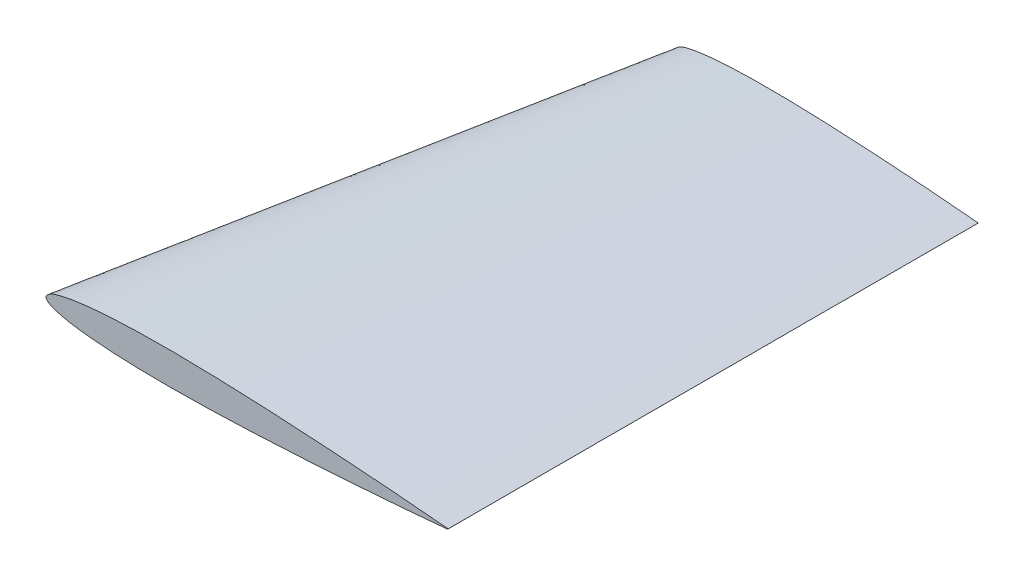
ISO-10303-21;
HEADER;
FILE_DESCRIPTION(('STEP AP214'),'2;1');
FILE_NAME('part.step','',(''),(''),'','','');
FILE_SCHEMA(('AUTOMOTIVE_DESIGN { 1 0 10303 214 1 1 1 1 }'));
ENDSEC;
DATA;
#1=APPLICATION_CONTEXT('core data for automotive mechanical design processes');
#2=APPLICATION_PROTOCOL_DEFINITION('international standard','automotive_design',2000,#1);
#3=PRODUCT_CONTEXT('',#1,'mechanical');
#4=PRODUCT('Part','Part','',(#3));
#5=PRODUCT_RELATED_PRODUCT_CATEGORY('part','',(#4));
#6=PRODUCT_DEFINITION_FORMATION('','',#4);
#7=PRODUCT_DEFINITION_CONTEXT('part definition',#1,'design');
#8=PRODUCT_DEFINITION('design','',#6,#7);
#9=PRODUCT_DEFINITION_SHAPE('','',#8);
#10=(LENGTH_UNIT() NAMED_UNIT(*) SI_UNIT(.MILLI.,.METRE.));
#11=(NAMED_UNIT(*) PLANE_ANGLE_UNIT() SI_UNIT($,.RADIAN.));
#12=(NAMED_UNIT(*) SI_UNIT($,.STERADIAN.) SOLID_ANGLE_UNIT());
#13=UNCERTAINTY_MEASURE_WITH_UNIT(LENGTH_MEASURE(1.E-05),#10,'distance_accuracy_value','');
#14=(GEOMETRIC_REPRESENTATION_CONTEXT(3) GLOBAL_UNCERTAINTY_ASSIGNED_CONTEXT((#13)) GLOBAL_UNIT_ASSIGNED_CONTEXT((#10,
#11,#12)) REPRESENTATION_CONTEXT('',''));
#15=CARTESIAN_POINT('',(0.,0.,0.));
#16=DIRECTION('',(0.,0.,1.));
#17=DIRECTION('',(1.,0.,0.));
#18=AXIS2_PLACEMENT_3D('',#15,#16,#17);
#19=CARTESIAN_POINT('',(0.,0.,0.));
#20=DIRECTION('',(0.,0.,-1.));
#21=DIRECTION('',(-1.,0.,0.));
#22=AXIS2_PLACEMENT_3D('',#19,#20,#21);
#23=PLANE('',#22);
#24=CARTESIAN_POINT('',(131.,0.11004,0.));
#25=CARTESIAN_POINT('',(128.816870347562,0.310137888872527,0.));
#26=CARTESIAN_POINT('',(124.451565090307,0.710246222010464,0.));
#27=CARTESIAN_POINT('',(115.719583103756,1.45527766400517,0.));
#28=CARTESIAN_POINT('',(104.804314296648,2.31033040372466,0.));
#29=CARTESIAN_POINT('',(91.7039286028267,3.21979881723269,0.));
#30=CARTESIAN_POINT('',(78.6040670592815,4.01088951775883,0.));
#31=CARTESIAN_POINT('',(65.5039412667009,4.65330236732744,0.));
#32=CARTESIAN_POINT('',(52.4034041105768,5.11285990678068,0.));
#33=CARTESIAN_POINT('',(41.4837195464556,5.27309079736383,0.));
#34=CARTESIAN_POINT('',(32.7488925264283,5.20978326604601,0.));
#35=CARTESIAN_POINT('',(26.1970860186864,5.03691908178291,0.));
#36=CARTESIAN_POINT('',(19.6413057022108,4.70615791578935,0.));
#37=CARTESIAN_POINT('',(14.1836111249939,4.24132356838005,0.));
#38=CARTESIAN_POINT('',(9.81066124828353,3.68636799044943,0.));
#39=CARTESIAN_POINT('',(6.54160899166983,3.14881170766803,0.));
#40=CARTESIAN_POINT('',(3.73301050518204,2.44698239752032,0.));
#41=CARTESIAN_POINT('',(1.52669168859384,1.73049329989823,0.));
#42=CARTESIAN_POINT('',(-0.870644057206406,0.,0.));
#43=CARTESIAN_POINT('',(1.52669168859384,-1.73049329989822,0.));
#44=CARTESIAN_POINT('',(3.73301050518204,-2.44698239752032,0.));
#45=CARTESIAN_POINT('',(6.54160899166982,-3.14881170766803,0.));
#46=CARTESIAN_POINT('',(9.81066124828353,-3.68636799044943,0.));
#47=CARTESIAN_POINT('',(14.1836111249939,-4.24132356838005,0.));
#48=CARTESIAN_POINT('',(19.6413057022108,-4.70615791578935,0.));
#49=CARTESIAN_POINT('',(26.1970860186863,-5.03691908178291,0.));
#50=CARTESIAN_POINT('',(32.7488925264283,-5.20978326604601,0.));
#51=CARTESIAN_POINT('',(41.4837195464556,-5.27309079736383,0.));
#52=CARTESIAN_POINT('',(52.4034041105768,-5.11285990678068,0.));
#53=CARTESIAN_POINT('',(65.503941266701,-4.65330236732744,0.));
#54=CARTESIAN_POINT('',(78.6040670592815,-4.01088951775883,0.));
#55=CARTESIAN_POINT('',(91.7039286028267,-3.21979881723269,0.));
#56=CARTESIAN_POINT('',(104.804314296648,-2.31033040372466,0.));
#57=CARTESIAN_POINT('',(115.719583103756,-1.45527766400517,0.));
#58=CARTESIAN_POINT('',(124.451565090307,-0.710246222010463,0.));
#59=CARTESIAN_POINT('',(128.816870347562,-0.310137888872527,0.));
#60=CARTESIAN_POINT('',(131.,-0.11004,0.));
#61=B_SPLINE_CURVE_WITH_KNOTS('',3,(#24,#25,#26,#27,#28,#29,#30,#31,#32,#33,#34,#35,#36,#37,#38,
#39,#40,#41,#42,#43,#44,#45,#46,#47,#48,#49,#50,#51,#52,#53,#54,#55,#56,#57,#58,#59,#60),
.UNSPECIFIED.,.F.,.F.,(4,1,1,1,1,1,1,1,1,1,1,1,1,1,1,1,1,1,1,1,1,1,1,1,1,1,1,1,1,1,1,1,1,1,4),
(0.,0.0248762929189861,0.0497417146704998,0.099443402111095,0.149112224036195,0.198750974066913,
0.248359097492202,0.297937369716024,0.347491327096237,0.37226694027957,0.39705092368842,
0.421859474838904,0.446731345826762,0.459220451479859,0.471790601601357,0.484560454432956,
0.491195112481227,0.5,0.508804887518773,0.515439545567044,0.528209398398643,0.540779548520141,
0.553268654173238,0.578140525161096,0.60294907631158,0.62773305972043,0.652508672903763,
0.702062630283976,0.751640902507798,0.801249025933087,0.850887775963805,0.900556597888905,
0.9502582853295,0.975123707081014,1.),.UNSPECIFIED.);
#62=CARTESIAN_POINT('',(131.,0.11004,0.));
#63=VERTEX_POINT('',#62);
#64=CARTESIAN_POINT('',(131.,-0.11004,0.));
#65=VERTEX_POINT('',#64);
#66=EDGE_CURVE('E81',#63,#65,#61,.T.);
#67=ORIENTED_EDGE('',*,*,#66,.T.);
#68=CARTESIAN_POINT('',(130.9899141255,0.,0.));
#69=DIRECTION('',(0.,0.,1.));
#70=DIRECTION('',(-1.,0.,0.));
#71=AXIS2_PLACEMENT_3D('',#68,#69,#70);
#72=CIRCLE('',#71,0.11050125096318);
#73=EDGE_CURVE('E12',#65,#63,#72,.T.);
#74=ORIENTED_EDGE('',*,*,#73,.T.);
#75=EDGE_LOOP('',(#67,#74));
#76=FACE_BOUND('',#75,.T.);
#77=ADVANCED_FACE('F71',(#76),#23,.F.);
#78=CARTESIAN_POINT('',(32.7000000000001,-0.082572000000003,-173.));
#79=DIRECTION('',(0.,0.,-1.));
#80=DIRECTION('',(-1.,0.,0.));
#81=AXIS2_PLACEMENT_3D('',#78,#79,#80);
#82=PLANE('',#81);
#83=CARTESIAN_POINT('',(131.,0.,-173.));
#84=CARTESIAN_POINT('',(129.361819505079,0.150149789894423,-173.));
#85=CARTESIAN_POINT('',(126.086174415093,0.450383752852127,-173.));
#86=CARTESIAN_POINT('',(119.533855107628,1.00944169749395,-173.));
#87=CARTESIAN_POINT('',(111.343237369164,1.6510576082911,-173.));
#88=CARTESIAN_POINT('',(101.512947951587,2.33350604377078,-173.));
#89=CARTESIAN_POINT('',(91.6830518467739,2.92712601218086,-173.));
#90=CARTESIAN_POINT('',(81.852957454326,3.40918084510142,-173.));
#91=CARTESIAN_POINT('',(72.0225543822115,3.75402440333237,-173.));
#92=CARTESIAN_POINT('',(63.8286231405847,3.8742587280982,-173.));
#93=CARTESIAN_POINT('',(57.2741689721214,3.82675391642994,-173.));
#94=CARTESIAN_POINT('',(52.3578134018082,3.69703979953633,-173.));
#95=CARTESIAN_POINT('',(47.4384759582238,3.44884268032131,-173.));
#96=CARTESIAN_POINT('',(43.3431219357779,3.10003950207449,-173.));
#97=CARTESIAN_POINT('',(40.0617404634067,2.68361100352044,-173.));
#98=CARTESIAN_POINT('',(37.6087035410775,2.28023861728066,-173.));
#99=CARTESIAN_POINT('',(35.5011826920565,1.75359876088738,-173.));
#100=CARTESIAN_POINT('',(33.8456014731968,1.21595846854958,-173.));
#101=CARTESIAN_POINT('',(32.0466846502032,-0.082572000000003,-173.));
#102=CARTESIAN_POINT('',(33.8456014731968,-1.38110246854959,-173.));
#103=CARTESIAN_POINT('',(35.5011826920565,-1.91874276088739,-173.));
#104=CARTESIAN_POINT('',(37.6087035410775,-2.44538261728067,-173.));
#105=CARTESIAN_POINT('',(40.0617404634067,-2.84875500352045,-173.));
#106=CARTESIAN_POINT('',(43.3431219357779,-3.2651835020745,-173.));
#107=CARTESIAN_POINT('',(47.4384759582239,-3.61398668032132,-173.));
#108=CARTESIAN_POINT('',(52.3578134018082,-3.86218379953634,-173.));
#109=CARTESIAN_POINT('',(57.2741689721214,-3.99189791642995,-173.));
#110=CARTESIAN_POINT('',(63.8286231405847,-4.0394027280982,-173.));
#111=CARTESIAN_POINT('',(72.0225543822115,-3.91916840333238,-173.));
#112=CARTESIAN_POINT('',(81.852957454326,-3.57432484510143,-173.));
#113=CARTESIAN_POINT('',(91.6830518467739,-3.09227001218087,-173.));
#114=CARTESIAN_POINT('',(101.512947951587,-2.49865004377079,-173.));
#115=CARTESIAN_POINT('',(111.343237369164,-1.81620160829111,-173.));
#116=CARTESIAN_POINT('',(119.533855107628,-1.17458569749396,-173.));
#117=CARTESIAN_POINT('',(126.086174415093,-0.615527752852125,-173.));
#118=CARTESIAN_POINT('',(129.361819505079,-0.315293789894429,-173.));
#119=CARTESIAN_POINT('',(131.,-0.165144000000006,-173.));
#120=B_SPLINE_CURVE_WITH_KNOTS('',3,(#83,#84,#85,#86,#87,#88,#89,#90,#91,#92,#93,#94,#95,#96,
#97,#98,#99,#100,#101,#102,#103,#104,#105,#106,#107,#108,#109,#110,#111,#112,#113,#114,#115,
#116,#117,#118,#119),.UNSPECIFIED.,.F.,.F.,(4,1,1,1,1,1,1,1,1,1,1,1,1,1,1,1,1,1,1,1,1,1,1,1,1,1,
1,1,1,1,1,1,1,1,4),(0.,0.0248762929189861,0.0497417146704998,0.099443402111095,
0.149112224036195,0.198750974066913,0.248359097492202,0.297937369716024,0.347491327096237,
0.37226694027957,0.39705092368842,0.421859474838904,0.446731345826762,0.459220451479859,
0.471790601601357,0.484560454432956,0.491195112481227,0.5,0.508804887518773,0.515439545567044,
0.528209398398643,0.540779548520141,0.553268654173238,0.578140525161096,0.60294907631158,
0.62773305972043,0.652508672903763,0.702062630283976,0.751640902507798,0.801249025933087,
0.850887775963805,0.900556597888905,0.9502582853295,0.975123707081014,1.),.UNSPECIFIED.);
#121=CARTESIAN_POINT('',(131.,0.,-173.));
#122=VERTEX_POINT('',#121);
#123=CARTESIAN_POINT('',(131.,-0.165144000000006,-173.));
#124=VERTEX_POINT('',#123);
#125=EDGE_CURVE('E103',#122,#124,#120,.T.);
#126=ORIENTED_EDGE('',*,*,#125,.F.);
#127=CARTESIAN_POINT('',(130.992431744555,-0.082572000000003,-173.));
#128=DIRECTION('',(0.,0.,1.));
#129=DIRECTION('',(-1.,0.,0.));
#130=AXIS2_PLACEMENT_3D('',#127,#128,#129);
#131=CIRCLE('',#130,0.0829181142723741);
#132=EDGE_CURVE('E99',#124,#122,#131,.T.);
#133=ORIENTED_EDGE('',*,*,#132,.F.);
#134=EDGE_LOOP('',(#126,#133));
#135=FACE_BOUND('',#134,.T.);
#136=ADVANCED_FACE('F110',(#135),#82,.T.);
#137=CARTESIAN_POINT('',(131.000000117433,-1.07634536310093E-08,-173.));
#138=CARTESIAN_POINT('',(131.000000156497,0.110039985656027,0.));
#139=CARTESIAN_POINT('',(128.940535608968,0.188763171437657,-173.));
#140=CARTESIAN_POINT('',(128.255444199133,0.361596210155981,0.));
#141=CARTESIAN_POINT('',(124.821417388266,0.564319355523281,-173.));
#142=CARTESIAN_POINT('',(122.766103718397,0.862343973612104,0.));
#143=CARTESIAN_POINT('',(118.638415811473,1.07835420981064,-173.));
#144=CARTESIAN_POINT('',(114.526264947384,1.54710386527621,0.));
#145=CARTESIAN_POINT('',(112.452854741183,1.56007575582809,-173.));
#146=CARTESIAN_POINT('',(106.28304933928,2.18911739577432,0.));
#147=CARTESIAN_POINT('',(107.295932793868,1.93129107762501,-173.));
#148=CARTESIAN_POINT('',(99.4106390484241,2.6837360028312,0.));
#149=CARTESIAN_POINT('',(103.169238375079,2.21140601886975,-173.));
#150=CARTESIAN_POINT('',(93.9111935478654,3.05717823238518,0.));
#151=CARTESIAN_POINT('',(100.07363496155,2.41271084376189,-173.));
#152=CARTESIAN_POINT('',(89.7857991751592,3.32524057747349,0.));
#153=CARTESIAN_POINT('',(96.9774447796151,2.60488156466758,-173.));
#154=CARTESIAN_POINT('',(85.6596633529894,3.58152165986858,0.));
#155=CARTESIAN_POINT('',(93.8806709355054,2.78731927908606,-173.));
#156=CARTESIAN_POINT('',(81.5327193590375,3.82453655105182,0.));
#157=CARTESIAN_POINT('',(90.7832868897655,2.95916377116404,-173.));
#158=CARTESIAN_POINT('',(77.404979763622,4.05360543696512,0.));
#159=CARTESIAN_POINT('',(87.6853015643457,3.11977639567504,-173.));
#160=CARTESIAN_POINT('',(73.2764295832048,4.2676150261703,0.));
#161=CARTESIAN_POINT('',(84.5867092984731,3.26826367325096,-173.));
#162=CARTESIAN_POINT('',(69.1470755263409,4.46551505606886,0.));
#163=CARTESIAN_POINT('',(81.487527498053,3.40388943812452,-173.));
#164=CARTESIAN_POINT('',(65.0169331076416,4.64624889820928,0.));
#165=CARTESIAN_POINT('',(78.3877704757895,3.52571419004602,-173.));
#166=CARTESIAN_POINT('',(60.8860255402092,4.80860291784415,0.));
#167=CARTESIAN_POINT('',(75.2874278431419,3.63167209711995,-173.));
#168=CARTESIAN_POINT('',(56.7543366940631,4.94980724428431,0.));
#169=CARTESIAN_POINT('',(72.1865240936337,3.71979595169325,-173.));
#170=CARTESIAN_POINT('',(52.6219005517895,5.06724286298066,0.));
#171=CARTESIAN_POINT('',(69.0851167521275,3.78807222525769,-173.));
#172=CARTESIAN_POINT('',(48.4887925059737,5.15824019944036,0.));
#173=CARTESIAN_POINT('',(65.9832894315635,3.83385619836307,-173.));
#174=CARTESIAN_POINT('',(44.3551260187667,5.21923688813428,0.));
#175=CARTESIAN_POINT('',(63.3982050168251,3.85089458530804,-173.));
#176=CARTESIAN_POINT('',(40.9100971235666,5.24197139286719,0.));
#177=CARTESIAN_POINT('',(61.3301034065557,3.85061251698062,-173.));
#178=CARTESIAN_POINT('',(38.154032222539,5.24155079378142,0.));
#179=CARTESIAN_POINT('',(59.7790484884829,3.84283285140709,-173.));
#180=CARTESIAN_POINT('',(36.087008896172,5.23123700158345,0.));
#181=CARTESIAN_POINT('',(58.2280531889082,3.82687334611934,-173.));
#182=CARTESIAN_POINT('',(34.0200678570569,5.20992524551563,0.));
#183=CARTESIAN_POINT('',(56.6771764854332,3.80193715981825,-173.));
#184=CARTESIAN_POINT('',(31.9532827829952,5.17671998816251,0.));
#185=CARTESIAN_POINT('',(55.1264822985738,3.76738953883367,-173.));
#186=CARTESIAN_POINT('',(29.8867421936242,5.13066537965312,0.));
#187=CARTESIAN_POINT('',(53.5760548668532,3.72240291490398,-173.));
#188=CARTESIAN_POINT('',(27.8205563689873,5.0707211443432,0.));
#189=CARTESIAN_POINT('',(52.0259882159556,3.66630644317744,-173.));
#190=CARTESIAN_POINT('',(25.7548518154808,4.99595987545832,0.));
#191=CARTESIAN_POINT('',(50.4764014926564,3.59817952830777,-173.));
#192=CARTESIAN_POINT('',(23.6897864395041,4.90517196351075,0.));
#193=CARTESIAN_POINT('',(48.927474033696,3.51633543285021,-173.));
#194=CARTESIAN_POINT('',(21.6256001695,4.79610035625126,0.));
#195=CARTESIAN_POINT('',(47.3794265324786,3.41921832074653,-173.));
#196=CARTESIAN_POINT('',(19.5625856983689,4.66667764298223,0.));
#197=CARTESIAN_POINT('',(45.8325277464505,3.30515882496449,-173.));
#198=CARTESIAN_POINT('',(17.5011033538569,4.51467288472591,0.));
#199=CARTESIAN_POINT('',(44.5447807859301,3.19336591990307,-173.));
#200=CARTESIAN_POINT('',(15.7849786937545,4.36569544410332,0.));
#201=CARTESIAN_POINT('',(43.5156681809466,3.09235968240072,-173.));
#202=CARTESIAN_POINT('',(14.4135294664583,4.23108375381585,0.));
#203=CARTESIAN_POINT('',(42.7444658980599,3.01043816350297,-173.));
#204=CARTESIAN_POINT('',(13.385781106398,4.12191362829317,0.));
#205=CARTESIAN_POINT('',(41.9739854751587,2.92196891978985,-173.));
#206=CARTESIAN_POINT('',(12.3589973740668,4.00401313339227,0.));
#207=CARTESIAN_POINT('',(41.2043428875929,2.82646830450108,-173.));
#208=CARTESIAN_POINT('',(11.3333282486829,3.87674401009911,0.));
#209=CARTESIAN_POINT('',(40.4357229827067,2.72305872677674,-173.));
#210=CARTESIAN_POINT('',(10.3090232603011,3.73893462844862,0.));
#211=CARTESIAN_POINT('',(39.6682444382446,2.61146330691477,-173.));
#212=CARTESIAN_POINT('',(9.28623851726055,3.5902148636516,0.));
#213=CARTESIAN_POINT('',(38.9023589118707,2.48935419852189,-173.));
#214=CARTESIAN_POINT('',(8.26557739202732,3.4274876845354,0.));
#215=CARTESIAN_POINT('',(38.138836201531,2.35313692738351,-173.));
#216=CARTESIAN_POINT('',(7.2480643669423,3.24595126301333,0.));
#217=CARTESIAN_POINT('',(37.3786014500763,2.19954960384283,-173.));
#218=CARTESIAN_POINT('',(6.23493427722526,3.04128108790434,0.));
#219=CARTESIAN_POINT('',(36.7484900177675,2.05566969539153,-173.));
#220=CARTESIAN_POINT('',(5.39520931104002,2.84953535395023,0.));
#221=CARTESIAN_POINT('',(36.2466224961136,1.93135286378312,-173.));
#222=CARTESIAN_POINT('',(4.72639886367298,2.68386081331163,0.));
#223=CARTESIAN_POINT('',(35.8714438922607,1.83332433349331,-173.));
#224=CARTESIAN_POINT('',(4.2264105959082,2.55323028788468,0.));
#225=CARTESIAN_POINT('',(35.4975985510859,1.73032044246021,-173.));
#226=CARTESIAN_POINT('',(3.7282104225839,2.41591404958276,0.));
#227=CARTESIAN_POINT('',(35.1251828457639,1.62224023712731,-173.));
#228=CARTESIAN_POINT('',(3.23189537991874,2.27200339042936,0.));
#229=CARTESIAN_POINT('',(34.7545537088725,1.50817514746575,-173.));
#230=CARTESIAN_POINT('',(2.73799932726427,2.11975240823985,0.));
#231=CARTESIAN_POINT('',(34.3899269745863,1.37547540052967,-173.));
#232=CARTESIAN_POINT('',(2.25202927867563,1.94337567298044,0.));
#233=CARTESIAN_POINT('',(34.0353007594544,1.21838536426618,-173.));
#234=CARTESIAN_POINT('',(1.77953847396634,1.73299573804488,0.));
#235=CARTESIAN_POINT('',(33.6933513264636,1.03404524712558,-173.));
#236=CARTESIAN_POINT('',(1.32363500835298,1.48942700626588,0.));
#237=CARTESIAN_POINT('',(33.3659880549214,0.827310352128222,-173.));
#238=CARTESIAN_POINT('',(0.88774557645086,1.21011633181188,0.));
#239=CARTESIAN_POINT('',(33.113056998186,0.622146887177472,-173.));
#240=CARTESIAN_POINT('',(0.550000905677161,0.943277856487526,0.));
#241=CARTESIAN_POINT('',(32.9315661431491,0.439806584908006,-173.));
#242=CARTESIAN_POINT('',(0.308996353752264,0.693100997607616,0.));
#243=CARTESIAN_POINT('',(32.7754810446941,0.234987146357228,-173.));
#244=CARTESIAN_POINT('',(0.100183316828995,0.425148090346884,0.));
#245=CARTESIAN_POINT('',(32.6495787708684,-0.0825720000000867,-173.));
#246=CARTESIAN_POINT('',(-0.0667596257623972,0.,0.));
#247=CARTESIAN_POINT('',(32.7754810446943,-0.400131146357346,-173.));
#248=CARTESIAN_POINT('',(0.100183316828977,-0.425148090346866,0.));
#249=CARTESIAN_POINT('',(32.9315661431492,-0.604950584908119,-173.));
#250=CARTESIAN_POINT('',(0.308996353752272,-0.693100997607628,0.));
#251=CARTESIAN_POINT('',(33.113056998186,-0.78729088717758,-173.));
#252=CARTESIAN_POINT('',(0.550000905677147,-0.943277856487522,0.));
#253=CARTESIAN_POINT('',(33.3659880549216,-0.992454352128306,-173.));
#254=CARTESIAN_POINT('',(0.887745576450866,-1.21011633181189,0.));
#255=CARTESIAN_POINT('',(33.6933513264637,-1.19918924712568,-173.));
#256=CARTESIAN_POINT('',(1.32363500835301,-1.4894270062659,0.));
#257=CARTESIAN_POINT('',(34.0353007594545,-1.38352936426624,-173.));
#258=CARTESIAN_POINT('',(1.77953847396635,-1.73299573804489,0.));
#259=CARTESIAN_POINT('',(34.3899269745864,-1.54061940052972,-173.));
#260=CARTESIAN_POINT('',(2.25202927867567,-1.94337567298044,0.));
#261=CARTESIAN_POINT('',(34.7545537088727,-1.6733191474658,-173.));
#262=CARTESIAN_POINT('',(2.73799932726427,-2.11975240823985,0.));
#263=CARTESIAN_POINT('',(35.1251828457639,-1.78738423712734,-172.999999999999));
#264=CARTESIAN_POINT('',(3.23189537991887,-2.27200339042939,0.));
#265=CARTESIAN_POINT('',(35.4975985510861,-1.89546444246025,-173.000000000001));
#266=CARTESIAN_POINT('',(3.72821042258396,-2.41591404958279,0.));
#267=CARTESIAN_POINT('',(35.8714438922607,-1.99846833349334,-173.));
#268=CARTESIAN_POINT('',(4.22641059590834,-2.55323028788471,0.));
#269=CARTESIAN_POINT('',(36.2466224961137,-2.09649686378314,-173.));
#270=CARTESIAN_POINT('',(4.72639886367303,-2.68386081331165,0.));
#271=CARTESIAN_POINT('',(36.7484900177676,-2.22081369539156,-173.));
#272=CARTESIAN_POINT('',(5.39520931104014,-2.84953535395025,0.));
#273=CARTESIAN_POINT('',(37.3786014500763,-2.36469360384285,-173.));
#274=CARTESIAN_POINT('',(6.23493427722531,-3.04128108790436,0.));
#275=CARTESIAN_POINT('',(38.1388362015312,-2.51828092738355,-173.));
#276=CARTESIAN_POINT('',(7.24806436694241,-3.24595126301334,0.));
#277=CARTESIAN_POINT('',(38.9023589118707,-2.65449819852191,-173.));
#278=CARTESIAN_POINT('',(8.2655773920274,-3.42748768453541,0.));
#279=CARTESIAN_POINT('',(39.6682444382447,-2.7766073069148,-173.));
#280=CARTESIAN_POINT('',(9.28623851726059,-3.59021486365161,0.));
#281=CARTESIAN_POINT('',(40.4357229827068,-2.88820272677675,-173.));
#282=CARTESIAN_POINT('',(10.3090232603012,-3.73893462844863,0.));
#283=CARTESIAN_POINT('',(41.204342887593,-2.9916123045011,-173.));
#284=CARTESIAN_POINT('',(11.3333282486829,-3.87674401009912,0.));
#285=CARTESIAN_POINT('',(41.9739854751588,-3.08711291978986,-173.));
#286=CARTESIAN_POINT('',(12.3589973740668,-4.00401313339227,0.));
#287=CARTESIAN_POINT('',(42.74446589806,-3.17558216350299,-173.));
#288=CARTESIAN_POINT('',(13.385781106398,-4.12191362829317,0.));
#289=CARTESIAN_POINT('',(43.5156681809466,-3.25750368240073,-173.));
#290=CARTESIAN_POINT('',(14.4135294664583,-4.23108375381584,0.));
#291=CARTESIAN_POINT('',(44.5447807859301,-3.35850991990307,-172.999999999999));
#292=CARTESIAN_POINT('',(15.7849786937544,-4.36569544410332,0.));
#293=CARTESIAN_POINT('',(45.8325277464507,-3.47030282496452,-173.000000000001));
#294=CARTESIAN_POINT('',(17.5011033538569,-4.51467288472591,0.));
#295=CARTESIAN_POINT('',(47.3794265324786,-3.58436232074654,-172.999999999999));
#296=CARTESIAN_POINT('',(19.5625856983689,-4.66667764298224,0.));
#297=CARTESIAN_POINT('',(48.9274740336963,-3.68147943285023,-173.000000000001));
#298=CARTESIAN_POINT('',(21.6256001695,-4.79610035625124,0.));
#299=CARTESIAN_POINT('',(50.4764014926563,-3.76332352830777,-173.));
#300=CARTESIAN_POINT('',(23.6897864395039,-4.90517196351075,0.));
#301=CARTESIAN_POINT('',(52.025988215956,-3.83145044317746,-173.));
#302=CARTESIAN_POINT('',(25.7548518154807,-4.99595987545831,0.));
#303=CARTESIAN_POINT('',(53.5760548668532,-3.88754691490399,-173.));
#304=CARTESIAN_POINT('',(27.8205563689872,-5.07072114434319,0.));
#305=CARTESIAN_POINT('',(55.1264822985741,-3.93253353883368,-173.));
#306=CARTESIAN_POINT('',(29.8867421936242,-5.13066537965311,0.));
#307=CARTESIAN_POINT('',(56.6771764854332,-3.96708115981826,-173.));
#308=CARTESIAN_POINT('',(31.9532827829951,-5.17671998816251,0.));
#309=CARTESIAN_POINT('',(58.2280531889084,-3.99201734611935,-173.));
#310=CARTESIAN_POINT('',(34.0200678570569,-5.20992524551563,0.));
#311=CARTESIAN_POINT('',(59.779048488483,-4.0079768514071,-173.));
#312=CARTESIAN_POINT('',(36.087008896172,-5.23123700158345,0.));
#313=CARTESIAN_POINT('',(61.3301034065558,-4.01575651698062,-173.));
#314=CARTESIAN_POINT('',(38.154032222539,-5.24155079378142,0.));
#315=CARTESIAN_POINT('',(63.3982050168255,-4.01603858530804,-173.));
#316=CARTESIAN_POINT('',(40.9100971235664,-5.24197139286718,0.));
#317=CARTESIAN_POINT('',(65.9832894315635,-3.99900019836307,-173.));
#318=CARTESIAN_POINT('',(44.3551260187666,-5.21923688813429,0.));
#319=CARTESIAN_POINT('',(69.0851167521276,-3.9532162252577,-173.));
#320=CARTESIAN_POINT('',(48.4887925059735,-5.15824019944035,0.));
#321=CARTESIAN_POINT('',(72.1865240936341,-3.88493995169325,-173.));
#322=CARTESIAN_POINT('',(52.6219005517893,-5.06724286298067,0.));
#323=CARTESIAN_POINT('',(75.2874278431418,-3.79681609711994,-173.));
#324=CARTESIAN_POINT('',(56.7543366940631,-4.94980724428433,0.));
#325=CARTESIAN_POINT('',(78.3877704757897,-3.69085819004603,-173.));
#326=CARTESIAN_POINT('',(60.8860255402089,-4.80860291784414,0.));
#327=CARTESIAN_POINT('',(81.4875274980529,-3.56903343812451,-173.));
#328=CARTESIAN_POINT('',(65.0169331076417,-4.6462488982093,0.));
#329=CARTESIAN_POINT('',(84.5867092984734,-3.43340767325098,-173.));
#330=CARTESIAN_POINT('',(69.1470755263407,-4.46551505606886,0.));
#331=CARTESIAN_POINT('',(87.6853015643457,-3.28492039567504,-173.));
#332=CARTESIAN_POINT('',(73.2764295832047,-4.26761502617031,0.));
#333=CARTESIAN_POINT('',(90.7832868897656,-3.12430777116406,-173.));
#334=CARTESIAN_POINT('',(77.4049797636218,-4.05360543696514,0.));
#335=CARTESIAN_POINT('',(93.8806709355054,-2.95246327908606,-173.));
#336=CARTESIAN_POINT('',(81.5327193590376,-3.82453655105182,0.));
#337=CARTESIAN_POINT('',(96.9774447796153,-2.77002556466759,-173.));
#338=CARTESIAN_POINT('',(85.6596633529892,-3.58152165986859,0.));
#339=CARTESIAN_POINT('',(100.07363496155,-2.57785484376188,-173.));
#340=CARTESIAN_POINT('',(89.7857991751593,-3.32524057747349,0.));
#341=CARTESIAN_POINT('',(103.169238375079,-2.37655001886975,-173.));
#342=CARTESIAN_POINT('',(93.9111935478651,-3.05717823238519,0.));
#343=CARTESIAN_POINT('',(107.295932793868,-2.09643507762502,-173.));
#344=CARTESIAN_POINT('',(99.4106390484243,-2.6837360028312,0.));
#345=CARTESIAN_POINT('',(112.452854741183,-1.7252197558281,-173.));
#346=CARTESIAN_POINT('',(106.28304933928,-2.18911739577432,0.));
#347=CARTESIAN_POINT('',(118.638415811473,-1.24349820981066,-173.));
#348=CARTESIAN_POINT('',(114.526264947384,-1.54710386527621,0.));
#349=CARTESIAN_POINT('',(124.821417388266,-0.729463355523268,-173.));
#350=CARTESIAN_POINT('',(122.766103718397,-0.862343973612098,0.));
#351=CARTESIAN_POINT('',(128.940535608968,-0.353907171437662,-173.));
#352=CARTESIAN_POINT('',(128.255444199133,-0.361596210155987,0.));
#353=CARTESIAN_POINT('',(131.020359437504,-0.163277926467178,-173.));
#354=CARTESIAN_POINT('',(131.027132108983,-0.107553167519838,0.));
#355=CARTESIAN_POINT('',(131.059530808792,-0.143884635650392,-173.));
#356=CARTESIAN_POINT('',(131.079334038166,-0.0817085988830536,0.));
#357=CARTESIAN_POINT('',(131.083328522875,-0.082485516983702,-173.));
#358=CARTESIAN_POINT('',(131.111048184096,0.000115252035989472,0.));
#359=CARTESIAN_POINT('',(131.059513407656,-0.021316554183271,-173.));
#360=CARTESIAN_POINT('',(131.079310848453,0.081632384557416,0.));
#361=CARTESIAN_POINT('',(131.020359437504,-0.0018660735328281,-173.));
#362=CARTESIAN_POINT('',(131.027132108983,0.107553167519831,0.));
#363=CARTESIAN_POINT('',(131.000000117433,-1.07634536310093E-08,-173.));
#364=CARTESIAN_POINT('',(131.000000156497,0.110039985656027,0.));
#365=B_SPLINE_SURFACE_WITH_KNOTS('',3,1,((#137,#138),(#139,#140),(#141,#142),(#143,#144),(#145,
#146),(#147,#148),(#149,#150),(#151,#152),(#153,#154),(#155,#156),(#157,#158),(#159,#160),(#161,
#162),(#163,#164),(#165,#166),(#167,#168),(#169,#170),(#171,#172),(#173,#174),(#175,#176),(#177,
#178),(#179,#180),(#181,#182),(#183,#184),(#185,#186),(#187,#188),(#189,#190),(#191,#192),(#193,
#194),(#195,#196),(#197,#198),(#199,#200),(#201,#202),(#203,#204),(#205,#206),(#207,#208),(#209,
#210),(#211,#212),(#213,#214),(#215,#216),(#217,#218),(#219,#220),(#221,#222),(#223,#224),(#225,
#226),(#227,#228),(#229,#230),(#231,#232),(#233,#234),(#235,#236),(#237,#238),(#239,#240),(#241,
#242),(#243,#244),(#245,#246),(#247,#248),(#249,#250),(#251,#252),(#253,#254),(#255,#256),(#257,
#258),(#259,#260),(#261,#262),(#263,#264),(#265,#266),(#267,#268),(#269,#270),(#271,#272),(#273,
#274),(#275,#276),(#277,#278),(#279,#280),(#281,#282),(#283,#284),(#285,#286),(#287,#288),(#289,
#290),(#291,#292),(#293,#294),(#295,#296),(#297,#298),(#299,#300),(#301,#302),(#303,#304),(#305,
#306),(#307,#308),(#309,#310),(#311,#312),(#313,#314),(#315,#316),(#317,#318),(#319,#320),(#321,
#322),(#323,#324),(#325,#326),(#327,#328),(#329,#330),(#331,#332),(#333,#334),(#335,#336),(#337,
#338),(#339,#340),(#341,#342),(#343,#344),(#345,#346),(#347,#348),(#349,#350),(#351,#352),(#353,
#354),(#355,#356),(#357,#358),(#359,#360),(#361,#362),(#363,#364)),.UNSPECIFIED.,.T.,.F.,.F.,(4,
1,1,1,1,1,1,1,1,1,1,1,1,1,1,1,1,1,1,1,1,1,1,1,1,1,1,1,1,1,1,1,1,1,1,1,1,1,1,1,1,1,1,1,1,1,1,1,1,
1,1,1,1,1,1,1,1,1,1,1,1,1,1,1,1,1,1,1,1,1,1,1,1,1,1,1,1,1,1,1,1,1,1,1,1,1,1,1,1,1,1,1,1,1,1,1,1,
1,1,1,1,1,1,1,1,1,2,1,1,1,4),(2,2),(0.,0.0312114315079636,0.0624228630159272,0.0936342945238908,
0.124845726031854,0.140451441785836,0.156057157539818,0.1716628732938,0.187268589047782,
0.202874304801763,0.218480020555745,0.234085736309727,0.249691452063709,0.265297167817691,
0.280902883571672,0.296508599325654,0.312114315079636,0.327720030833618,0.3433257465876,
0.35112860446459,0.358931462341582,0.366734320218572,0.374537178095563,0.382340035972554,
0.390142893849545,0.397945751726536,0.405748609603527,0.413551467480518,0.421354325357509,
0.4291571832345,0.436960041111491,0.440861470049986,0.444762898988481,0.448664327926977,
0.452565756865472,0.456467185803968,0.460368614742463,0.464270043680959,0.468171472619454,
0.47207290155795,0.475974330496445,0.477925044965693,0.47987575943494,0.481826473904188,
0.483777188373436,0.485727902842684,0.487678617311931,0.489629331781179,0.491580046250427,
0.493530760719674,0.495481475188922,0.496456832423546,0.49743218965817,0.499382904127418,
0.501333618596665,0.502308975831289,0.503284333065913,0.505235047535161,0.507185762004409,
0.509136476473656,0.511087190942904,0.513037905412152,0.514988619881399,0.516939334350647,
0.518890048819895,0.520840763289143,0.52279147775839,0.526692906696886,0.530594335635381,
0.534495764573877,0.538397193512372,0.542298622450868,0.546200051389363,0.550101480327859,
0.554002909266354,0.55790433820485,0.561805767143345,0.569608625020336,0.577411482897327,
0.585214340774318,0.593017198651309,0.6008200565283,0.60862291440529,0.616425772282281,
0.624228630159272,0.632031488036263,0.639834345913254,0.647637203790245,0.655440061667236,
0.671045777421218,0.686651493175199,0.702257208929181,0.717862924683163,0.733468640437145,
0.749074356191126,0.764680071945108,0.78028578769909,0.795891503453072,0.811497219207054,
0.827102934961036,0.842708650715017,0.858314366468999,0.873920082222981,0.905131513730944,
0.936342945238908,0.967554376746872,0.998765808254836,0.999074356191127,0.999382904127418,
0.999691452063709,1.),(0.,1.),.UNSPECIFIED.);
#366=ORIENTED_EDGE('',*,*,#132,.T.);
#367=ORIENTED_EDGE('',*,*,#125,.T.);
#368=EDGE_LOOP('',(#366,#367));
#369=FACE_BOUND('',#368,.T.);
#370=ORIENTED_EDGE('',*,*,#66,.F.);
#371=ORIENTED_EDGE('',*,*,#73,.F.);
#372=EDGE_LOOP('',(#370,#371));
#373=FACE_BOUND('',#372,.T.);
#374=ADVANCED_FACE('F102',(#369,#373),#365,.T.);
#375=CLOSED_SHELL('',(#77,#136,#374));
#376=MANIFOLD_SOLID_BREP('B2',#375);
#377=ADVANCED_BREP_SHAPE_REPRESENTATION('',(#18,#376),#14);
#378=SHAPE_DEFINITION_REPRESENTATION(#9,#377);
ENDSEC;
END-ISO-10303-21;
